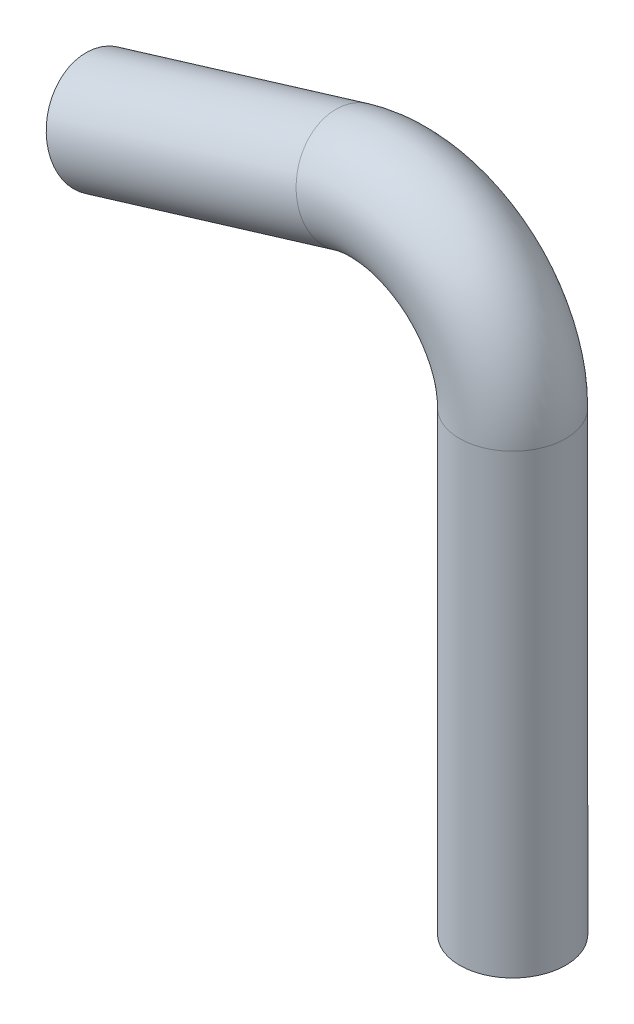
ISO-10303-21;
HEADER;
FILE_DESCRIPTION(('STEP AP214'),'2;1');
FILE_NAME('part.step','',(''),(''),'','','');
FILE_SCHEMA(('AUTOMOTIVE_DESIGN { 1 0 10303 214 1 1 1 1 }'));
ENDSEC;
DATA;
#1=APPLICATION_CONTEXT('core data for automotive mechanical design processes');
#2=APPLICATION_PROTOCOL_DEFINITION('international standard','automotive_design',2000,#1);
#3=PRODUCT_CONTEXT('',#1,'mechanical');
#4=PRODUCT('Part','Part','',(#3));
#5=PRODUCT_RELATED_PRODUCT_CATEGORY('part','',(#4));
#6=PRODUCT_DEFINITION_FORMATION('','',#4);
#7=PRODUCT_DEFINITION_CONTEXT('part definition',#1,'design');
#8=PRODUCT_DEFINITION('design','',#6,#7);
#9=PRODUCT_DEFINITION_SHAPE('','',#8);
#10=(LENGTH_UNIT() NAMED_UNIT(*) SI_UNIT(.MILLI.,.METRE.));
#11=(NAMED_UNIT(*) PLANE_ANGLE_UNIT() SI_UNIT($,.RADIAN.));
#12=(NAMED_UNIT(*) SI_UNIT($,.STERADIAN.) SOLID_ANGLE_UNIT());
#13=UNCERTAINTY_MEASURE_WITH_UNIT(LENGTH_MEASURE(1.E-05),#10,'distance_accuracy_value','');
#14=(GEOMETRIC_REPRESENTATION_CONTEXT(3) GLOBAL_UNCERTAINTY_ASSIGNED_CONTEXT((#13)) GLOBAL_UNIT_ASSIGNED_CONTEXT((#10,
#11,#12)) REPRESENTATION_CONTEXT('',''));
#15=CARTESIAN_POINT('',(0.,0.,0.));
#16=DIRECTION('',(0.,0.,1.));
#17=DIRECTION('',(1.,0.,0.));
#18=AXIS2_PLACEMENT_3D('',#15,#16,#17);
#19=CARTESIAN_POINT('',(0.,0.,0.));
#20=DIRECTION('',(0.,1.,0.));
#21=DIRECTION('',(0.,0.,1.));
#22=AXIS2_PLACEMENT_3D('',#19,#20,#21);
#23=CYLINDRICAL_SURFACE('',#22,21.59);
#24=CARTESIAN_POINT('',(0.,185.469049606693,0.));
#25=DIRECTION('',(0.,1.,0.));
#26=DIRECTION('',(0.,0.,1.));
#27=AXIS2_PLACEMENT_3D('',#24,#25,#26);
#28=CIRCLE('',#27,21.59);
#29=CARTESIAN_POINT('',(21.59,185.469049606693,0.));
#30=VERTEX_POINT('',#29);
#31=EDGE_CURVE('E80',#30,#30,#28,.T.);
#32=ORIENTED_EDGE('',*,*,#31,.F.);
#33=EDGE_LOOP('',(#32));
#34=FACE_BOUND('',#33,.T.);
#35=CARTESIAN_POINT('',(0.,0.,0.));
#36=DIRECTION('',(0.,1.,0.));
#37=DIRECTION('',(0.,0.,1.));
#38=AXIS2_PLACEMENT_3D('',#35,#36,#37);
#39=CIRCLE('',#38,21.59);
#40=CARTESIAN_POINT('',(0.,0.,21.59));
#41=VERTEX_POINT('',#40);
#42=EDGE_CURVE('E49',#41,#41,#39,.T.);
#43=ORIENTED_EDGE('',*,*,#42,.T.);
#44=EDGE_LOOP('',(#43));
#45=FACE_BOUND('',#44,.T.);
#46=ADVANCED_FACE('F34',(#34,#45),#23,.T.);
#47=CARTESIAN_POINT('',(-50.8,185.469049606693,0.));
#48=DIRECTION('',(0.,0.,1.));
#49=DIRECTION('',(1.,0.,0.));
#50=AXIS2_PLACEMENT_3D('',#47,#48,#49);
#51=TOROIDAL_SURFACE('',#50,50.8,21.59);
#52=CARTESIAN_POINT('',(-65.5702764496015,234.074388136554,0.));
#53=DIRECTION('',(-0.95679800255631,-0.290753473417352,0.));
#54=DIRECTION('',(0.,0.,1.));
#55=AXIS2_PLACEMENT_3D('',#52,#53,#54);
#56=CIRCLE('',#55,21.59);
#57=CARTESIAN_POINT('',(-71.8476439406821,254.731657011745,0.));
#58=VERTEX_POINT('',#57);
#59=EDGE_CURVE('E38',#58,#58,#56,.T.);
#60=CARTESIAN_POINT('',(-50.8,185.469049606693,0.));
#61=DIRECTION('',(0.,0.,1.));
#62=DIRECTION('',(1.,0.,0.));
#63=AXIS2_PLACEMENT_3D('',#60,#61,#62);
#64=CIRCLE('',#63,72.39);
#65=EDGE_CURVE('',#30,#58,#64,.T.);
#66=ORIENTED_EDGE('',*,*,#31,.T.);
#67=ORIENTED_EDGE('',*,*,#59,.F.);
#68=ORIENTED_EDGE('',*,*,#65,.T.);
#69=ORIENTED_EDGE('',*,*,#65,.F.);
#70=EDGE_LOOP('',(#66,#68,#67,#69));
#71=FACE_BOUND('',#70,.T.);
#72=ADVANCED_FACE('F88',(#71),#51,.T.);
#73=CARTESIAN_POINT('',(-65.5702764496015,234.074388136554,0.));
#74=DIRECTION('',(-0.95679800255631,-0.290753473417352,0.));
#75=DIRECTION('',(0.290753473417352,-0.95679800255631,0.));
#76=AXIS2_PLACEMENT_3D('',#73,#74,#75);
#77=CYLINDRICAL_SURFACE('',#76,21.59);
#78=CARTESIAN_POINT('',(-167.170276449601,203.2,0.));
#79=DIRECTION('',(-0.95679800255631,-0.290753473417352,0.));
#80=DIRECTION('',(0.,0.,1.));
#81=AXIS2_PLACEMENT_3D('',#78,#79,#80);
#82=CIRCLE('',#81,21.59);
#83=CARTESIAN_POINT('',(-167.170276449601,203.2,21.59));
#84=VERTEX_POINT('',#83);
#85=EDGE_CURVE('E54',#84,#84,#82,.T.);
#86=ORIENTED_EDGE('',*,*,#85,.F.);
#87=EDGE_LOOP('',(#86));
#88=FACE_BOUND('',#87,.T.);
#89=ORIENTED_EDGE('',*,*,#59,.T.);
#90=EDGE_LOOP('',(#89));
#91=FACE_BOUND('',#90,.T.);
#92=ADVANCED_FACE('F36',(#88,#91),#77,.T.);
#93=CARTESIAN_POINT('',(0.,0.,0.));
#94=DIRECTION('',(0.,1.,0.));
#95=DIRECTION('',(0.,0.,1.));
#96=AXIS2_PLACEMENT_3D('',#93,#94,#95);
#97=PLANE('',#96);
#98=CARTESIAN_POINT('',(0.,0.,0.));
#99=DIRECTION('',(0.,1.,0.));
#100=DIRECTION('',(0.,0.,1.));
#101=AXIS2_PLACEMENT_3D('',#98,#99,#100);
#102=CIRCLE('',#101,19.05);
#103=CARTESIAN_POINT('',(0.,0.,19.05));
#104=VERTEX_POINT('',#103);
#105=EDGE_CURVE('E75',#104,#104,#102,.F.);
#106=ORIENTED_EDGE('',*,*,#105,.F.);
#107=EDGE_LOOP('',(#106));
#108=FACE_BOUND('',#107,.T.);
#109=ORIENTED_EDGE('',*,*,#42,.F.);
#110=EDGE_LOOP('',(#109));
#111=FACE_BOUND('',#110,.T.);
#112=ADVANCED_FACE('F94',(#108,#111),#97,.F.);
#113=CARTESIAN_POINT('',(-167.170276449601,203.2,0.));
#114=DIRECTION('',(-0.95679800255631,-0.290753473417352,0.));
#115=DIRECTION('',(0.,0.,1.));
#116=AXIS2_PLACEMENT_3D('',#113,#114,#115);
#117=PLANE('',#116);
#118=CARTESIAN_POINT('',(-167.170276449601,203.2,0.));
#119=DIRECTION('',(-0.95679800255631,-0.290753473417352,0.));
#120=DIRECTION('',(0.,0.,1.));
#121=AXIS2_PLACEMENT_3D('',#118,#119,#120);
#122=CIRCLE('',#121,19.05);
#123=CARTESIAN_POINT('',(-167.170276449601,203.2,19.05));
#124=VERTEX_POINT('',#123);
#125=EDGE_CURVE('E11',#124,#124,#122,.F.);
#126=ORIENTED_EDGE('',*,*,#125,.T.);
#127=EDGE_LOOP('',(#126));
#128=FACE_BOUND('',#127,.T.);
#129=ORIENTED_EDGE('',*,*,#85,.T.);
#130=EDGE_LOOP('',(#129));
#131=FACE_BOUND('',#130,.T.);
#132=ADVANCED_FACE('F61',(#128,#131),#117,.T.);
#133=CARTESIAN_POINT('',(0.,0.,0.));
#134=DIRECTION('',(0.,1.,0.));
#135=DIRECTION('',(0.,0.,1.));
#136=AXIS2_PLACEMENT_3D('',#133,#134,#135);
#137=CYLINDRICAL_SURFACE('',#136,19.05);
#138=CARTESIAN_POINT('',(0.,185.469049606693,0.));
#139=DIRECTION('',(0.,1.,0.));
#140=DIRECTION('',(0.,0.,1.));
#141=AXIS2_PLACEMENT_3D('',#138,#139,#140);
#142=CIRCLE('',#141,19.05);
#143=CARTESIAN_POINT('',(19.05,185.469049606693,0.));
#144=VERTEX_POINT('',#143);
#145=EDGE_CURVE('E72',#144,#144,#142,.F.);
#146=ORIENTED_EDGE('',*,*,#145,.F.);
#147=EDGE_LOOP('',(#146));
#148=FACE_BOUND('',#147,.T.);
#149=ORIENTED_EDGE('',*,*,#105,.T.);
#150=EDGE_LOOP('',(#149));
#151=FACE_BOUND('',#150,.T.);
#152=ADVANCED_FACE('F102',(#148,#151),#137,.F.);
#153=CARTESIAN_POINT('',(-50.8,185.469049606693,0.));
#154=DIRECTION('',(0.,0.,1.));
#155=DIRECTION('',(1.,0.,0.));
#156=AXIS2_PLACEMENT_3D('',#153,#154,#155);
#157=TOROIDAL_SURFACE('',#156,50.8,19.05);
#158=CARTESIAN_POINT('',(-65.5702764496015,234.074388136554,0.));
#159=DIRECTION('',(-0.95679800255631,-0.290753473417352,0.));
#160=DIRECTION('',(0.,0.,1.));
#161=AXIS2_PLACEMENT_3D('',#158,#159,#160);
#162=CIRCLE('',#161,19.05);
#163=CARTESIAN_POINT('',(-71.109130118202,252.301390085252,0.));
#164=VERTEX_POINT('',#163);
#165=EDGE_CURVE('E43',#164,#164,#162,.F.);
#166=CARTESIAN_POINT('',(-50.8,185.469049606693,0.));
#167=DIRECTION('',(0.,0.,1.));
#168=DIRECTION('',(1.,0.,0.));
#169=AXIS2_PLACEMENT_3D('',#166,#167,#168);
#170=CIRCLE('',#169,69.85);
#171=EDGE_CURVE('',#144,#164,#170,.T.);
#172=ORIENTED_EDGE('',*,*,#145,.T.);
#173=ORIENTED_EDGE('',*,*,#165,.F.);
#174=ORIENTED_EDGE('',*,*,#171,.T.);
#175=ORIENTED_EDGE('',*,*,#171,.F.);
#176=EDGE_LOOP('',(#172,#174,#173,#175));
#177=FACE_BOUND('',#176,.T.);
#178=ADVANCED_FACE('F67',(#177),#157,.F.);
#179=CARTESIAN_POINT('',(-65.5702764496015,234.074388136554,0.));
#180=DIRECTION('',(-0.95679800255631,-0.290753473417352,0.));
#181=DIRECTION('',(0.290753473417352,-0.95679800255631,0.));
#182=AXIS2_PLACEMENT_3D('',#179,#180,#181);
#183=CYLINDRICAL_SURFACE('',#182,19.05);
#184=ORIENTED_EDGE('',*,*,#125,.F.);
#185=EDGE_LOOP('',(#184));
#186=FACE_BOUND('',#185,.T.);
#187=ORIENTED_EDGE('',*,*,#165,.T.);
#188=EDGE_LOOP('',(#187));
#189=FACE_BOUND('',#188,.T.);
#190=ADVANCED_FACE('F64',(#186,#189),#183,.F.);
#191=CLOSED_SHELL('',(#46,#72,#92,#112,#132,#152,#178,#190));
#192=MANIFOLD_SOLID_BREP('B2',#191);
#193=ADVANCED_BREP_SHAPE_REPRESENTATION('',(#18,#192),#14);
#194=SHAPE_DEFINITION_REPRESENTATION(#9,#193);
ENDSEC;
END-ISO-10303-21;
